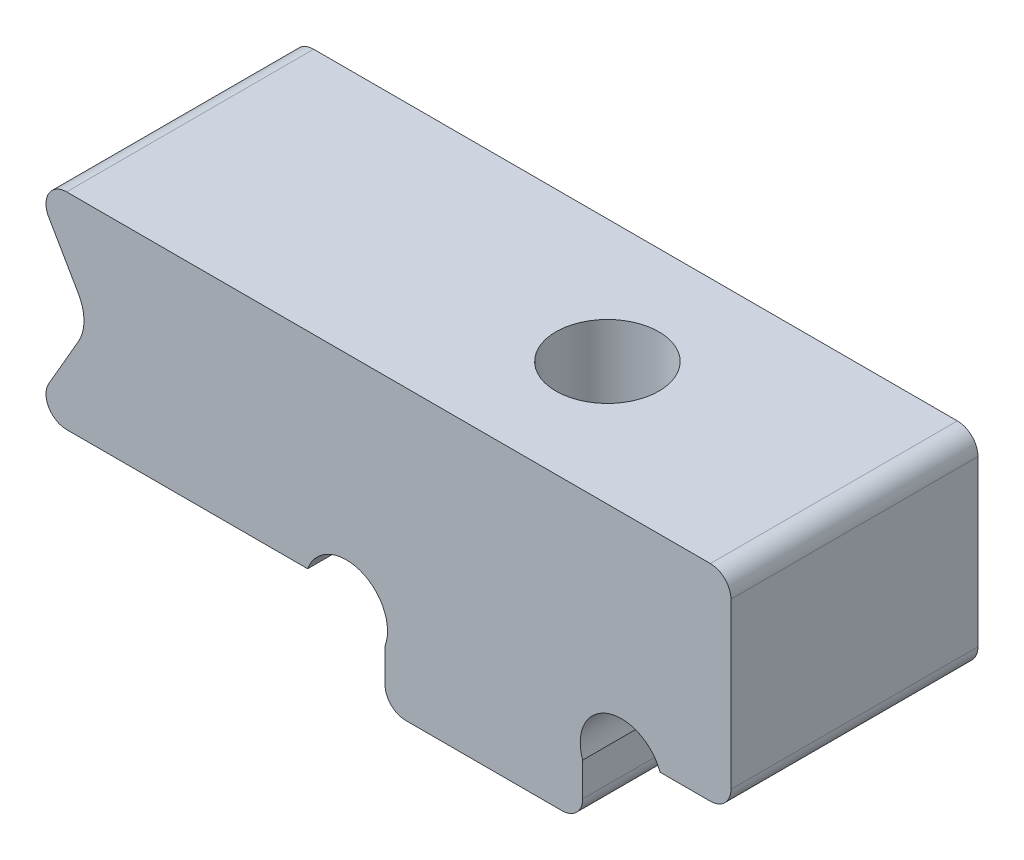
ISO-10303-21;
HEADER;
FILE_DESCRIPTION(('STEP AP214'),'2;1');
FILE_NAME('part.step','',(''),(''),'','','');
FILE_SCHEMA(('AUTOMOTIVE_DESIGN { 1 0 10303 214 1 1 1 1 }'));
ENDSEC;
DATA;
#1=APPLICATION_CONTEXT('core data for automotive mechanical design processes');
#2=APPLICATION_PROTOCOL_DEFINITION('international standard','automotive_design',2000,#1);
#3=PRODUCT_CONTEXT('',#1,'mechanical');
#4=PRODUCT('Part','Part','',(#3));
#5=PRODUCT_RELATED_PRODUCT_CATEGORY('part','',(#4));
#6=PRODUCT_DEFINITION_FORMATION('','',#4);
#7=PRODUCT_DEFINITION_CONTEXT('part definition',#1,'design');
#8=PRODUCT_DEFINITION('design','',#6,#7);
#9=PRODUCT_DEFINITION_SHAPE('','',#8);
#10=(LENGTH_UNIT() NAMED_UNIT(*) SI_UNIT(.MILLI.,.METRE.));
#11=(NAMED_UNIT(*) PLANE_ANGLE_UNIT() SI_UNIT($,.RADIAN.));
#12=(NAMED_UNIT(*) SI_UNIT($,.STERADIAN.) SOLID_ANGLE_UNIT());
#13=UNCERTAINTY_MEASURE_WITH_UNIT(LENGTH_MEASURE(1.E-05),#10,'distance_accuracy_value','');
#14=(GEOMETRIC_REPRESENTATION_CONTEXT(3) GLOBAL_UNCERTAINTY_ASSIGNED_CONTEXT((#13)) GLOBAL_UNIT_ASSIGNED_CONTEXT((#10,
#11,#12)) REPRESENTATION_CONTEXT('',''));
#15=CARTESIAN_POINT('',(0.,0.,0.));
#16=DIRECTION('',(0.,0.,1.));
#17=DIRECTION('',(1.,0.,0.));
#18=AXIS2_PLACEMENT_3D('',#15,#16,#17);
#19=CARTESIAN_POINT('',(6.,0.,3.));
#20=DIRECTION('',(-1.,0.,0.));
#21=DIRECTION('',(0.,0.,1.));
#22=AXIS2_PLACEMENT_3D('',#19,#20,#21);
#23=PLANE('',#22);
#24=DIRECTION('',(0.,1.,0.));
#25=VECTOR('',#24,1.);
#26=CARTESIAN_POINT('',(6.,0.,-3.));
#27=LINE('',#26,#25);
#28=CARTESIAN_POINT('',(6.,0.499999999999999,-3.));
#29=VERTEX_POINT('',#28);
#30=CARTESIAN_POINT('',(6.,4.5,-3.));
#31=VERTEX_POINT('',#30);
#32=EDGE_CURVE('E221',#29,#31,#27,.T.);
#33=ORIENTED_EDGE('',*,*,#32,.T.);
#34=DIRECTION('',(0.,0.,-1.));
#35=VECTOR('',#34,1.);
#36=CARTESIAN_POINT('',(6.,4.5,3.));
#37=LINE('',#36,#35);
#38=CARTESIAN_POINT('',(6.,4.5,3.));
#39=VERTEX_POINT('',#38);
#40=EDGE_CURVE('E278',#31,#39,#37,.F.);
#41=ORIENTED_EDGE('',*,*,#40,.T.);
#42=DIRECTION('',(0.,1.,0.));
#43=VECTOR('',#42,1.);
#44=CARTESIAN_POINT('',(6.,0.,3.));
#45=LINE('',#44,#43);
#46=CARTESIAN_POINT('',(6.,0.499999999999999,3.));
#47=VERTEX_POINT('',#46);
#48=EDGE_CURVE('E247',#47,#39,#45,.T.);
#49=ORIENTED_EDGE('',*,*,#48,.F.);
#50=DIRECTION('',(0.,0.,-1.));
#51=VECTOR('',#50,1.);
#52=CARTESIAN_POINT('',(6.,0.499999999999999,3.));
#53=LINE('',#52,#51);
#54=EDGE_CURVE('E274',#47,#29,#53,.T.);
#55=ORIENTED_EDGE('',*,*,#54,.T.);
#56=EDGE_LOOP('',(#33,#41,#49,#55));
#57=FACE_BOUND('',#56,.T.);
#58=ADVANCED_FACE('F49',(#57),#23,.F.);
#59=CARTESIAN_POINT('',(-6.,5.,3.));
#60=DIRECTION('',(0.,-1.,0.));
#61=DIRECTION('',(0.,0.,-1.));
#62=AXIS2_PLACEMENT_3D('',#59,#60,#61);
#63=PLANE('',#62);
#64=CARTESIAN_POINT('',(0.,5.,0.));
#65=DIRECTION('',(0.,1.,0.));
#66=DIRECTION('',(0.,0.,1.));
#67=AXIS2_PLACEMENT_3D('',#64,#65,#66);
#68=CIRCLE('',#67,1.25);
#69=CARTESIAN_POINT('',(0.,5.,1.25));
#70=VERTEX_POINT('',#69);
#71=EDGE_CURVE('E370',#70,#70,#68,.T.);
#72=ORIENTED_EDGE('',*,*,#71,.F.);
#73=EDGE_LOOP('',(#72));
#74=FACE_BOUND('',#73,.T.);
#75=DIRECTION('',(-1.,0.,0.));
#76=VECTOR('',#75,1.);
#77=CARTESIAN_POINT('',(-6.,5.,3.));
#78=LINE('',#77,#76);
#79=CARTESIAN_POINT('',(5.5,5.,3.));
#80=VERTEX_POINT('',#79);
#81=CARTESIAN_POINT('',(-10.1339745962156,5.,3.));
#82=VERTEX_POINT('',#81);
#83=EDGE_CURVE('E210',#80,#82,#78,.T.);
#84=ORIENTED_EDGE('',*,*,#83,.F.);
#85=DIRECTION('',(0.,0.,-1.));
#86=VECTOR('',#85,1.);
#87=CARTESIAN_POINT('',(5.5,5.,3.));
#88=LINE('',#87,#86);
#89=CARTESIAN_POINT('',(5.5,5.,-3.));
#90=VERTEX_POINT('',#89);
#91=EDGE_CURVE('E250',#80,#90,#88,.T.);
#92=ORIENTED_EDGE('',*,*,#91,.T.);
#93=DIRECTION('',(-1.,0.,0.));
#94=VECTOR('',#93,1.);
#95=CARTESIAN_POINT('',(-6.,5.,-3.));
#96=LINE('',#95,#94);
#97=CARTESIAN_POINT('',(-10.1339745962156,5.,-3.));
#98=VERTEX_POINT('',#97);
#99=EDGE_CURVE('E225',#90,#98,#96,.T.);
#100=ORIENTED_EDGE('',*,*,#99,.T.);
#101=DIRECTION('',(0.,0.,-1.));
#102=VECTOR('',#101,1.);
#103=CARTESIAN_POINT('',(-10.1339745962156,5.,3.));
#104=LINE('',#103,#102);
#105=EDGE_CURVE('E220',#98,#82,#104,.F.);
#106=ORIENTED_EDGE('',*,*,#105,.T.);
#107=EDGE_LOOP('',(#84,#92,#100,#106));
#108=FACE_BOUND('',#107,.T.);
#109=ADVANCED_FACE('F423',(#74,#108),#63,.F.);
#110=CARTESIAN_POINT('',(-6.,0.,3.));
#111=DIRECTION('',(0.,1.,0.));
#112=DIRECTION('',(-1.,0.,0.));
#113=AXIS2_PLACEMENT_3D('',#110,#111,#112);
#114=PLANE('',#113);
#115=DIRECTION('',(1.,0.,0.));
#116=VECTOR('',#115,1.);
#117=CARTESIAN_POINT('',(-6.,0.,-3.));
#118=LINE('',#117,#116);
#119=CARTESIAN_POINT('',(-10.1339745962156,0.,-3.));
#120=VERTEX_POINT('',#119);
#121=CARTESIAN_POINT('',(-4.27938524157181,0.,-3.));
#122=VERTEX_POINT('',#121);
#123=EDGE_CURVE('E230',#120,#122,#118,.T.);
#124=ORIENTED_EDGE('',*,*,#123,.T.);
#125=DIRECTION('',(0.,0.,-1.));
#126=VECTOR('',#125,1.);
#127=CARTESIAN_POINT('',(-4.27938524157181,0.,3.));
#128=LINE('',#127,#126);
#129=CARTESIAN_POINT('',(-4.27938524157181,0.,3.));
#130=VERTEX_POINT('',#129);
#131=EDGE_CURVE('E184',#130,#122,#128,.T.);
#132=ORIENTED_EDGE('',*,*,#131,.F.);
#133=DIRECTION('',(1.,0.,0.));
#134=VECTOR('',#133,1.);
#135=CARTESIAN_POINT('',(-6.,0.,3.));
#136=LINE('',#135,#134);
#137=CARTESIAN_POINT('',(-10.1339745962156,0.,3.));
#138=VERTEX_POINT('',#137);
#139=EDGE_CURVE('E191',#138,#130,#136,.T.);
#140=ORIENTED_EDGE('',*,*,#139,.F.);
#141=DIRECTION('',(0.,0.,1.));
#142=VECTOR('',#141,1.);
#143=CARTESIAN_POINT('',(-10.1339745962156,0.,3.));
#144=LINE('',#143,#142);
#145=EDGE_CURVE('E324',#138,#120,#144,.F.);
#146=ORIENTED_EDGE('',*,*,#145,.T.);
#147=EDGE_LOOP('',(#124,#132,#140,#146));
#148=FACE_BOUND('',#147,.T.);
#149=ADVANCED_FACE('F398',(#148),#114,.F.);
#150=CARTESIAN_POINT('',(-2.4,0.,3.));
#151=DIRECTION('',(1.,0.,0.));
#152=DIRECTION('',(0.,1.,0.));
#153=AXIS2_PLACEMENT_3D('',#150,#151,#152);
#154=PLANE('',#153);
#155=DIRECTION('',(0.,-1.,0.));
#156=VECTOR('',#155,1.);
#157=CARTESIAN_POINT('',(-2.4,0.,3.));
#158=LINE('',#157,#156);
#159=CARTESIAN_POINT('',(-2.4,-0.684040286651345,3.));
#160=VERTEX_POINT('',#159);
#161=CARTESIAN_POINT('',(-2.4,-1.5,3.));
#162=VERTEX_POINT('',#161);
#163=EDGE_CURVE('E188',#160,#162,#158,.T.);
#164=ORIENTED_EDGE('',*,*,#163,.F.);
#165=DIRECTION('',(0.,0.,-1.));
#166=VECTOR('',#165,1.);
#167=CARTESIAN_POINT('',(-2.4,-0.684040286651345,3.));
#168=LINE('',#167,#166);
#169=CARTESIAN_POINT('',(-2.4,-0.684040286651345,-3.));
#170=VERTEX_POINT('',#169);
#171=EDGE_CURVE('E174',#160,#170,#168,.T.);
#172=ORIENTED_EDGE('',*,*,#171,.T.);
#173=DIRECTION('',(0.,-1.,0.));
#174=VECTOR('',#173,1.);
#175=CARTESIAN_POINT('',(-2.4,0.,-3.));
#176=LINE('',#175,#174);
#177=CARTESIAN_POINT('',(-2.4,-1.5,-3.));
#178=VERTEX_POINT('',#177);
#179=EDGE_CURVE('E234',#170,#178,#176,.T.);
#180=ORIENTED_EDGE('',*,*,#179,.T.);
#181=DIRECTION('',(0.,0.,-1.));
#182=VECTOR('',#181,1.);
#183=CARTESIAN_POINT('',(-2.4,-1.5,3.));
#184=LINE('',#183,#182);
#185=EDGE_CURVE('E197',#178,#162,#184,.F.);
#186=ORIENTED_EDGE('',*,*,#185,.T.);
#187=EDGE_LOOP('',(#164,#172,#180,#186));
#188=FACE_BOUND('',#187,.T.);
#189=ADVANCED_FACE('F195',(#188),#154,.F.);
#190=CARTESIAN_POINT('',(-2.4,-2.,3.));
#191=DIRECTION('',(0.,1.,0.));
#192=DIRECTION('',(-1.,0.,0.));
#193=AXIS2_PLACEMENT_3D('',#190,#191,#192);
#194=PLANE('',#193);
#195=CARTESIAN_POINT('',(0.,-2.,0.));
#196=DIRECTION('',(0.,1.,0.));
#197=DIRECTION('',(0.,0.,1.));
#198=AXIS2_PLACEMENT_3D('',#195,#196,#197);
#199=CIRCLE('',#198,1.25);
#200=CARTESIAN_POINT('',(0.,-2.,1.25));
#201=VERTEX_POINT('',#200);
#202=EDGE_CURVE('E226',#201,#201,#199,.T.);
#203=ORIENTED_EDGE('',*,*,#202,.T.);
#204=EDGE_LOOP('',(#203));
#205=FACE_BOUND('',#204,.T.);
#206=DIRECTION('',(1.,0.,0.));
#207=VECTOR('',#206,1.);
#208=CARTESIAN_POINT('',(-2.4,-2.,-3.));
#209=LINE('',#208,#207);
#210=CARTESIAN_POINT('',(-1.9,-2.,-3.));
#211=VERTEX_POINT('',#210);
#212=CARTESIAN_POINT('',(1.9,-2.,-3.));
#213=VERTEX_POINT('',#212);
#214=EDGE_CURVE('E237',#211,#213,#209,.T.);
#215=ORIENTED_EDGE('',*,*,#214,.T.);
#216=DIRECTION('',(0.,0.,-1.));
#217=VECTOR('',#216,1.);
#218=CARTESIAN_POINT('',(1.9,-2.,3.));
#219=LINE('',#218,#217);
#220=CARTESIAN_POINT('',(1.9,-2.,3.));
#221=VERTEX_POINT('',#220);
#222=EDGE_CURVE('E311',#213,#221,#219,.F.);
#223=ORIENTED_EDGE('',*,*,#222,.T.);
#224=DIRECTION('',(1.,0.,0.));
#225=VECTOR('',#224,1.);
#226=CARTESIAN_POINT('',(-2.4,-2.,3.));
#227=LINE('',#226,#225);
#228=CARTESIAN_POINT('',(-1.9,-2.,3.));
#229=VERTEX_POINT('',#228);
#230=EDGE_CURVE('E200',#229,#221,#227,.T.);
#231=ORIENTED_EDGE('',*,*,#230,.F.);
#232=DIRECTION('',(0.,0.,-1.));
#233=VECTOR('',#232,1.);
#234=CARTESIAN_POINT('',(-1.9,-2.,3.));
#235=LINE('',#234,#233);
#236=EDGE_CURVE('E307',#229,#211,#235,.T.);
#237=ORIENTED_EDGE('',*,*,#236,.T.);
#238=EDGE_LOOP('',(#215,#223,#231,#237));
#239=FACE_BOUND('',#238,.T.);
#240=ADVANCED_FACE('F448',(#205,#239),#194,.F.);
#241=CARTESIAN_POINT('',(2.4,0.,3.));
#242=DIRECTION('',(-1.,0.,0.));
#243=DIRECTION('',(0.,-1.,0.));
#244=AXIS2_PLACEMENT_3D('',#241,#242,#243);
#245=PLANE('',#244);
#246=DIRECTION('',(0.,1.,0.));
#247=VECTOR('',#246,1.);
#248=CARTESIAN_POINT('',(2.4,0.,-3.));
#249=LINE('',#248,#247);
#250=CARTESIAN_POINT('',(2.4,-1.5,-3.));
#251=VERTEX_POINT('',#250);
#252=CARTESIAN_POINT('',(2.4,-0.684040286651345,-3.));
#253=VERTEX_POINT('',#252);
#254=EDGE_CURVE('E241',#251,#253,#249,.T.);
#255=ORIENTED_EDGE('',*,*,#254,.T.);
#256=DIRECTION('',(0.,0.,-1.));
#257=VECTOR('',#256,1.);
#258=CARTESIAN_POINT('',(2.4,-0.684040286651345,3.));
#259=LINE('',#258,#257);
#260=CARTESIAN_POINT('',(2.4,-0.684040286651345,3.));
#261=VERTEX_POINT('',#260);
#262=EDGE_CURVE('E346',#261,#253,#259,.T.);
#263=ORIENTED_EDGE('',*,*,#262,.F.);
#264=DIRECTION('',(0.,1.,0.));
#265=VECTOR('',#264,1.);
#266=CARTESIAN_POINT('',(2.4,0.,3.));
#267=LINE('',#266,#265);
#268=CARTESIAN_POINT('',(2.4,-1.5,3.));
#269=VERTEX_POINT('',#268);
#270=EDGE_CURVE('E207',#269,#261,#267,.T.);
#271=ORIENTED_EDGE('',*,*,#270,.F.);
#272=DIRECTION('',(0.,0.,-1.));
#273=VECTOR('',#272,1.);
#274=CARTESIAN_POINT('',(2.4,-1.5,3.));
#275=LINE('',#274,#273);
#276=EDGE_CURVE('E304',#269,#251,#275,.T.);
#277=ORIENTED_EDGE('',*,*,#276,.T.);
#278=EDGE_LOOP('',(#255,#263,#271,#277));
#279=FACE_BOUND('',#278,.T.);
#280=ADVANCED_FACE('F451',(#279),#245,.F.);
#281=CARTESIAN_POINT('',(6.,0.,3.));
#282=DIRECTION('',(0.,1.,0.));
#283=DIRECTION('',(-1.,0.,0.));
#284=AXIS2_PLACEMENT_3D('',#281,#282,#283);
#285=PLANE('',#284);
#286=DIRECTION('',(1.,0.,0.));
#287=VECTOR('',#286,1.);
#288=CARTESIAN_POINT('',(6.,0.,3.));
#289=LINE('',#288,#287);
#290=CARTESIAN_POINT('',(4.27938524157181,0.,3.));
#291=VERTEX_POINT('',#290);
#292=CARTESIAN_POINT('',(5.5,0.,3.));
#293=VERTEX_POINT('',#292);
#294=EDGE_CURVE('E217',#291,#293,#289,.T.);
#295=ORIENTED_EDGE('',*,*,#294,.F.);
#296=DIRECTION('',(0.,0.,-1.));
#297=VECTOR('',#296,1.);
#298=CARTESIAN_POINT('',(4.27938524157181,0.,3.));
#299=LINE('',#298,#297);
#300=CARTESIAN_POINT('',(4.27938524157181,0.,-3.));
#301=VERTEX_POINT('',#300);
#302=EDGE_CURVE('E343',#291,#301,#299,.T.);
#303=ORIENTED_EDGE('',*,*,#302,.T.);
#304=DIRECTION('',(1.,0.,0.));
#305=VECTOR('',#304,1.);
#306=CARTESIAN_POINT('',(6.,0.,-3.));
#307=LINE('',#306,#305);
#308=CARTESIAN_POINT('',(5.5,0.,-3.));
#309=VERTEX_POINT('',#308);
#310=EDGE_CURVE('E244',#301,#309,#307,.T.);
#311=ORIENTED_EDGE('',*,*,#310,.T.);
#312=DIRECTION('',(0.,0.,-1.));
#313=VECTOR('',#312,1.);
#314=CARTESIAN_POINT('',(5.5,0.,3.));
#315=LINE('',#314,#313);
#316=EDGE_CURVE('E300',#309,#293,#315,.F.);
#317=ORIENTED_EDGE('',*,*,#316,.T.);
#318=EDGE_LOOP('',(#295,#303,#311,#317));
#319=FACE_BOUND('',#318,.T.);
#320=ADVANCED_FACE('F349',(#319),#285,.F.);
#321=CARTESIAN_POINT('',(0.,0.,3.));
#322=DIRECTION('',(0.,0.,-1.));
#323=DIRECTION('',(-1.,0.,0.));
#324=AXIS2_PLACEMENT_3D('',#321,#322,#323);
#325=PLANE('',#324);
#326=ORIENTED_EDGE('',*,*,#139,.T.);
#327=CARTESIAN_POINT('',(-3.33969262078591,-0.342020143325673,3.));
#328=DIRECTION('',(0.,0.,-1.));
#329=DIRECTION('',(-1.,0.,0.));
#330=AXIS2_PLACEMENT_3D('',#327,#328,#329);
#331=CIRCLE('',#330,1.);
#332=EDGE_CURVE('E178',#130,#160,#331,.T.);
#333=ORIENTED_EDGE('',*,*,#332,.T.);
#334=ORIENTED_EDGE('',*,*,#163,.T.);
#335=CARTESIAN_POINT('',(-1.9,-1.5,3.));
#336=DIRECTION('',(0.,0.,-1.));
#337=DIRECTION('',(-1.,0.,0.));
#338=AXIS2_PLACEMENT_3D('',#335,#336,#337);
#339=CIRCLE('',#338,0.5);
#340=EDGE_CURVE('E288',#162,#229,#339,.F.);
#341=ORIENTED_EDGE('',*,*,#340,.T.);
#342=ORIENTED_EDGE('',*,*,#230,.T.);
#343=CARTESIAN_POINT('',(1.9,-1.5,3.));
#344=DIRECTION('',(0.,0.,-1.));
#345=DIRECTION('',(-1.,0.,0.));
#346=AXIS2_PLACEMENT_3D('',#343,#344,#345);
#347=CIRCLE('',#346,0.5);
#348=EDGE_CURVE('E291',#221,#269,#347,.F.);
#349=ORIENTED_EDGE('',*,*,#348,.T.);
#350=ORIENTED_EDGE('',*,*,#270,.T.);
#351=CARTESIAN_POINT('',(3.33969262078591,-0.342020143325673,3.));
#352=DIRECTION('',(0.,0.,-1.));
#353=DIRECTION('',(1.,0.,0.));
#354=AXIS2_PLACEMENT_3D('',#351,#352,#353);
#355=CIRCLE('',#354,1.);
#356=EDGE_CURVE('E193',#261,#291,#355,.T.);
#357=ORIENTED_EDGE('',*,*,#356,.T.);
#358=ORIENTED_EDGE('',*,*,#294,.T.);
#359=CARTESIAN_POINT('',(5.5,0.499999999999999,3.));
#360=DIRECTION('',(0.,0.,-1.));
#361=DIRECTION('',(-1.,0.,0.));
#362=AXIS2_PLACEMENT_3D('',#359,#360,#361);
#363=CIRCLE('',#362,0.5);
#364=EDGE_CURVE('E294',#293,#47,#363,.F.);
#365=ORIENTED_EDGE('',*,*,#364,.T.);
#366=ORIENTED_EDGE('',*,*,#48,.T.);
#367=CARTESIAN_POINT('',(5.5,4.5,3.));
#368=DIRECTION('',(0.,0.,-1.));
#369=DIRECTION('',(-1.,0.,0.));
#370=AXIS2_PLACEMENT_3D('',#367,#368,#369);
#371=CIRCLE('',#370,0.5);
#372=EDGE_CURVE('E297',#39,#80,#371,.F.);
#373=ORIENTED_EDGE('',*,*,#372,.T.);
#374=ORIENTED_EDGE('',*,*,#83,.T.);
#375=CARTESIAN_POINT('',(-10.1339745962156,4.5,3.));
#376=DIRECTION('',(0.,0.,-1.));
#377=DIRECTION('',(-1.,0.,0.));
#378=AXIS2_PLACEMENT_3D('',#375,#376,#377);
#379=CIRCLE('',#378,0.5);
#380=CARTESIAN_POINT('',(-10.5669872981078,4.25,3.));
#381=VERTEX_POINT('',#380);
#382=EDGE_CURVE('E284',#82,#381,#379,.F.);
#383=ORIENTED_EDGE('',*,*,#382,.T.);
#384=DIRECTION('',(-0.500000000000001,0.866025403784438,0.));
#385=VECTOR('',#384,1.);
#386=CARTESIAN_POINT('',(-11.,5.,3.));
#387=LINE('',#386,#385);
#388=CARTESIAN_POINT('',(-9.84529946162075,3.,3.));
#389=VERTEX_POINT('',#388);
#390=EDGE_CURVE('E378',#389,#381,#387,.T.);
#391=ORIENTED_EDGE('',*,*,#390,.F.);
#392=CARTESIAN_POINT('',(-10.7113248654052,2.5,3.));
#393=DIRECTION('',(0.,0.,-1.));
#394=DIRECTION('',(-1.,0.,0.));
#395=AXIS2_PLACEMENT_3D('',#392,#393,#394);
#396=CIRCLE('',#395,1.);
#397=CARTESIAN_POINT('',(-9.84529946162075,2.,3.));
#398=VERTEX_POINT('',#397);
#399=EDGE_CURVE('E72',#389,#398,#396,.T.);
#400=ORIENTED_EDGE('',*,*,#399,.T.);
#401=DIRECTION('',(0.500000000000001,0.866025403784438,0.));
#402=VECTOR('',#401,1.);
#403=CARTESIAN_POINT('',(-9.55662432702593,2.5,3.));
#404=LINE('',#403,#402);
#405=CARTESIAN_POINT('',(-10.5669872981078,0.75,3.));
#406=VERTEX_POINT('',#405);
#407=EDGE_CURVE('E382',#406,#398,#404,.T.);
#408=ORIENTED_EDGE('',*,*,#407,.F.);
#409=CARTESIAN_POINT('',(-10.1339745962156,0.499999999999999,3.));
#410=DIRECTION('',(0.,0.,-1.));
#411=DIRECTION('',(-1.,0.,0.));
#412=AXIS2_PLACEMENT_3D('',#409,#410,#411);
#413=CIRCLE('',#412,0.5);
#414=EDGE_CURVE('E281',#406,#138,#413,.F.);
#415=ORIENTED_EDGE('',*,*,#414,.T.);
#416=EDGE_LOOP('',(#326,#333,#334,#341,#342,#349,#350,#357,#358,#365,#366,#373,#374,#383,#391,
#400,#408,#415));
#417=FACE_BOUND('',#416,.T.);
#418=ADVANCED_FACE('F187',(#417),#325,.F.);
#419=CARTESIAN_POINT('',(0.,0.,-3.));
#420=DIRECTION('',(0.,0.,-1.));
#421=DIRECTION('',(-1.,0.,0.));
#422=AXIS2_PLACEMENT_3D('',#419,#420,#421);
#423=PLANE('',#422);
#424=CARTESIAN_POINT('',(-3.33969262078591,-0.342020143325673,-3.));
#425=DIRECTION('',(0.,0.,-1.));
#426=DIRECTION('',(-1.,0.,0.));
#427=AXIS2_PLACEMENT_3D('',#424,#425,#426);
#428=CIRCLE('',#427,1.);
#429=EDGE_CURVE('E11',#122,#170,#428,.T.);
#430=ORIENTED_EDGE('',*,*,#429,.F.);
#431=ORIENTED_EDGE('',*,*,#123,.F.);
#432=CARTESIAN_POINT('',(-10.1339745962156,0.499999999999999,-3.));
#433=DIRECTION('',(0.,0.,-1.));
#434=DIRECTION('',(-1.,0.,0.));
#435=AXIS2_PLACEMENT_3D('',#432,#433,#434);
#436=CIRCLE('',#435,0.5);
#437=CARTESIAN_POINT('',(-10.5669872981078,0.75,-3.));
#438=VERTEX_POINT('',#437);
#439=EDGE_CURVE('E254',#120,#438,#436,.T.);
#440=ORIENTED_EDGE('',*,*,#439,.T.);
#441=DIRECTION('',(0.500000000000001,0.866025403784438,0.));
#442=VECTOR('',#441,1.);
#443=CARTESIAN_POINT('',(-9.55662432702593,2.5,-3.));
#444=LINE('',#443,#442);
#445=CARTESIAN_POINT('',(-9.84529946162075,2.,-3.));
#446=VERTEX_POINT('',#445);
#447=EDGE_CURVE('E381',#438,#446,#444,.T.);
#448=ORIENTED_EDGE('',*,*,#447,.T.);
#449=CARTESIAN_POINT('',(-10.7113248654052,2.5,-3.));
#450=DIRECTION('',(0.,0.,-1.));
#451=DIRECTION('',(-1.,0.,0.));
#452=AXIS2_PLACEMENT_3D('',#449,#450,#451);
#453=CIRCLE('',#452,1.);
#454=CARTESIAN_POINT('',(-9.84529946162075,3.,-3.));
#455=VERTEX_POINT('',#454);
#456=EDGE_CURVE('E336',#446,#455,#453,.F.);
#457=ORIENTED_EDGE('',*,*,#456,.T.);
#458=DIRECTION('',(-0.500000000000001,0.866025403784438,0.));
#459=VECTOR('',#458,1.);
#460=CARTESIAN_POINT('',(-11.,5.,-3.));
#461=LINE('',#460,#459);
#462=CARTESIAN_POINT('',(-10.5669872981078,4.25,-3.));
#463=VERTEX_POINT('',#462);
#464=EDGE_CURVE('E374',#455,#463,#461,.T.);
#465=ORIENTED_EDGE('',*,*,#464,.T.);
#466=CARTESIAN_POINT('',(-10.1339745962156,4.5,-3.));
#467=DIRECTION('',(0.,0.,-1.));
#468=DIRECTION('',(-1.,0.,0.));
#469=AXIS2_PLACEMENT_3D('',#466,#467,#468);
#470=CIRCLE('',#469,0.5);
#471=EDGE_CURVE('E257',#463,#98,#470,.T.);
#472=ORIENTED_EDGE('',*,*,#471,.T.);
#473=ORIENTED_EDGE('',*,*,#99,.F.);
#474=CARTESIAN_POINT('',(5.5,4.5,-3.));
#475=DIRECTION('',(0.,0.,-1.));
#476=DIRECTION('',(-1.,0.,0.));
#477=AXIS2_PLACEMENT_3D('',#474,#475,#476);
#478=CIRCLE('',#477,0.5);
#479=EDGE_CURVE('E271',#90,#31,#478,.T.);
#480=ORIENTED_EDGE('',*,*,#479,.T.);
#481=ORIENTED_EDGE('',*,*,#32,.F.);
#482=CARTESIAN_POINT('',(5.5,0.499999999999999,-3.));
#483=DIRECTION('',(0.,0.,-1.));
#484=DIRECTION('',(-1.,0.,0.));
#485=AXIS2_PLACEMENT_3D('',#482,#483,#484);
#486=CIRCLE('',#485,0.5);
#487=EDGE_CURVE('E267',#29,#309,#486,.T.);
#488=ORIENTED_EDGE('',*,*,#487,.T.);
#489=ORIENTED_EDGE('',*,*,#310,.F.);
#490=CARTESIAN_POINT('',(3.33969262078591,-0.342020143325673,-3.));
#491=DIRECTION('',(0.,0.,-1.));
#492=DIRECTION('',(-1.,0.,0.));
#493=AXIS2_PLACEMENT_3D('',#490,#491,#492);
#494=CIRCLE('',#493,1.);
#495=EDGE_CURVE('E58',#253,#301,#494,.T.);
#496=ORIENTED_EDGE('',*,*,#495,.F.);
#497=ORIENTED_EDGE('',*,*,#254,.F.);
#498=CARTESIAN_POINT('',(1.9,-1.5,-3.));
#499=DIRECTION('',(0.,0.,-1.));
#500=DIRECTION('',(-1.,0.,0.));
#501=AXIS2_PLACEMENT_3D('',#498,#499,#500);
#502=CIRCLE('',#501,0.5);
#503=EDGE_CURVE('E264',#251,#213,#502,.T.);
#504=ORIENTED_EDGE('',*,*,#503,.T.);
#505=ORIENTED_EDGE('',*,*,#214,.F.);
#506=CARTESIAN_POINT('',(-1.9,-1.5,-3.));
#507=DIRECTION('',(0.,0.,-1.));
#508=DIRECTION('',(-1.,0.,0.));
#509=AXIS2_PLACEMENT_3D('',#506,#507,#508);
#510=CIRCLE('',#509,0.5);
#511=EDGE_CURVE('E260',#211,#178,#510,.T.);
#512=ORIENTED_EDGE('',*,*,#511,.T.);
#513=ORIENTED_EDGE('',*,*,#179,.F.);
#514=EDGE_LOOP('',(#430,#431,#440,#448,#457,#465,#472,#473,#480,#481,#488,#489,#496,#497,#504,
#505,#512,#513));
#515=FACE_BOUND('',#514,.T.);
#516=ADVANCED_FACE('F352',(#515),#423,.T.);
#517=CARTESIAN_POINT('',(0.,-2.,0.));
#518=DIRECTION('',(0.,1.,0.));
#519=DIRECTION('',(0.,0.,1.));
#520=AXIS2_PLACEMENT_3D('',#517,#518,#519);
#521=CYLINDRICAL_SURFACE('',#520,1.25);
#522=ORIENTED_EDGE('',*,*,#202,.F.);
#523=EDGE_LOOP('',(#522));
#524=FACE_BOUND('',#523,.T.);
#525=ORIENTED_EDGE('',*,*,#71,.T.);
#526=EDGE_LOOP('',(#525));
#527=FACE_BOUND('',#526,.T.);
#528=ADVANCED_FACE('F460',(#524,#527),#521,.F.);
#529=CARTESIAN_POINT('',(-11.,5.,-3.));
#530=DIRECTION('',(0.866025403784438,0.500000000000001,0.));
#531=DIRECTION('',(-0.500000000000001,0.866025403784438,0.));
#532=AXIS2_PLACEMENT_3D('',#529,#530,#531);
#533=PLANE('',#532);
#534=ORIENTED_EDGE('',*,*,#464,.F.);
#535=DIRECTION('',(0.,0.,1.));
#536=VECTOR('',#535,1.);
#537=CARTESIAN_POINT('',(-9.84529946162075,3.,3.));
#538=LINE('',#537,#536);
#539=EDGE_CURVE('E327',#455,#389,#538,.T.);
#540=ORIENTED_EDGE('',*,*,#539,.T.);
#541=ORIENTED_EDGE('',*,*,#390,.T.);
#542=DIRECTION('',(0.,0.,-1.));
#543=VECTOR('',#542,1.);
#544=CARTESIAN_POINT('',(-10.5669872981078,4.25,-3.));
#545=LINE('',#544,#543);
#546=EDGE_CURVE('E316',#381,#463,#545,.T.);
#547=ORIENTED_EDGE('',*,*,#546,.T.);
#548=EDGE_LOOP('',(#534,#540,#541,#547));
#549=FACE_BOUND('',#548,.T.);
#550=ADVANCED_FACE('F413',(#549),#533,.F.);
#551=CARTESIAN_POINT('',(-9.55662432702593,2.5,-3.));
#552=DIRECTION('',(0.866025403784438,-0.500000000000001,0.));
#553=DIRECTION('',(0.500000000000001,0.866025403784438,0.));
#554=AXIS2_PLACEMENT_3D('',#551,#552,#553);
#555=PLANE('',#554);
#556=ORIENTED_EDGE('',*,*,#407,.T.);
#557=DIRECTION('',(0.,0.,1.));
#558=VECTOR('',#557,1.);
#559=CARTESIAN_POINT('',(-9.84529946162075,2.,-3.));
#560=LINE('',#559,#558);
#561=EDGE_CURVE('E331',#398,#446,#560,.F.);
#562=ORIENTED_EDGE('',*,*,#561,.T.);
#563=ORIENTED_EDGE('',*,*,#447,.F.);
#564=DIRECTION('',(0.,0.,1.));
#565=VECTOR('',#564,1.);
#566=CARTESIAN_POINT('',(-10.5669872981078,0.749999999999999,-3.));
#567=LINE('',#566,#565);
#568=EDGE_CURVE('E320',#438,#406,#567,.T.);
#569=ORIENTED_EDGE('',*,*,#568,.T.);
#570=EDGE_LOOP('',(#556,#562,#563,#569));
#571=FACE_BOUND('',#570,.T.);
#572=ADVANCED_FACE('F406',(#571),#555,.F.);
#573=CARTESIAN_POINT('',(5.5,4.5,3.));
#574=DIRECTION('',(0.,0.,-1.));
#575=DIRECTION('',(-1.,0.,0.));
#576=AXIS2_PLACEMENT_3D('',#573,#574,#575);
#577=CYLINDRICAL_SURFACE('',#576,0.5);
#578=ORIENTED_EDGE('',*,*,#372,.F.);
#579=ORIENTED_EDGE('',*,*,#40,.F.);
#580=ORIENTED_EDGE('',*,*,#479,.F.);
#581=ORIENTED_EDGE('',*,*,#91,.F.);
#582=EDGE_LOOP('',(#578,#579,#580,#581));
#583=FACE_BOUND('',#582,.T.);
#584=ADVANCED_FACE('F426',(#583),#577,.T.);
#585=CARTESIAN_POINT('',(5.5,0.499999999999999,3.));
#586=DIRECTION('',(0.,0.,-1.));
#587=DIRECTION('',(-1.,0.,0.));
#588=AXIS2_PLACEMENT_3D('',#585,#586,#587);
#589=CYLINDRICAL_SURFACE('',#588,0.5);
#590=ORIENTED_EDGE('',*,*,#364,.F.);
#591=ORIENTED_EDGE('',*,*,#316,.F.);
#592=ORIENTED_EDGE('',*,*,#487,.F.);
#593=ORIENTED_EDGE('',*,*,#54,.F.);
#594=EDGE_LOOP('',(#590,#591,#592,#593));
#595=FACE_BOUND('',#594,.T.);
#596=ADVANCED_FACE('F358',(#595),#589,.T.);
#597=CARTESIAN_POINT('',(1.9,-1.5,3.));
#598=DIRECTION('',(0.,0.,-1.));
#599=DIRECTION('',(-1.,0.,0.));
#600=AXIS2_PLACEMENT_3D('',#597,#598,#599);
#601=CYLINDRICAL_SURFACE('',#600,0.5);
#602=ORIENTED_EDGE('',*,*,#348,.F.);
#603=ORIENTED_EDGE('',*,*,#222,.F.);
#604=ORIENTED_EDGE('',*,*,#503,.F.);
#605=ORIENTED_EDGE('',*,*,#276,.F.);
#606=EDGE_LOOP('',(#602,#603,#604,#605));
#607=FACE_BOUND('',#606,.T.);
#608=ADVANCED_FACE('F433',(#607),#601,.T.);
#609=CARTESIAN_POINT('',(-1.9,-1.5,3.));
#610=DIRECTION('',(0.,0.,-1.));
#611=DIRECTION('',(-1.,0.,0.));
#612=AXIS2_PLACEMENT_3D('',#609,#610,#611);
#613=CYLINDRICAL_SURFACE('',#612,0.5);
#614=ORIENTED_EDGE('',*,*,#340,.F.);
#615=ORIENTED_EDGE('',*,*,#185,.F.);
#616=ORIENTED_EDGE('',*,*,#511,.F.);
#617=ORIENTED_EDGE('',*,*,#236,.F.);
#618=EDGE_LOOP('',(#614,#615,#616,#617));
#619=FACE_BOUND('',#618,.T.);
#620=ADVANCED_FACE('F489',(#619),#613,.T.);
#621=CARTESIAN_POINT('',(-10.1339745962156,4.5,-3.));
#622=DIRECTION('',(0.,0.,-1.));
#623=DIRECTION('',(-1.,0.,0.));
#624=AXIS2_PLACEMENT_3D('',#621,#622,#623);
#625=CYLINDRICAL_SURFACE('',#624,0.5);
#626=ORIENTED_EDGE('',*,*,#382,.F.);
#627=ORIENTED_EDGE('',*,*,#105,.F.);
#628=ORIENTED_EDGE('',*,*,#471,.F.);
#629=ORIENTED_EDGE('',*,*,#546,.F.);
#630=EDGE_LOOP('',(#626,#627,#628,#629));
#631=FACE_BOUND('',#630,.T.);
#632=ADVANCED_FACE('F420',(#631),#625,.T.);
#633=CARTESIAN_POINT('',(-10.1339745962156,0.499999999999999,-3.));
#634=DIRECTION('',(0.,0.,1.));
#635=DIRECTION('',(1.,0.,0.));
#636=AXIS2_PLACEMENT_3D('',#633,#634,#635);
#637=CYLINDRICAL_SURFACE('',#636,0.5);
#638=ORIENTED_EDGE('',*,*,#439,.F.);
#639=ORIENTED_EDGE('',*,*,#145,.F.);
#640=ORIENTED_EDGE('',*,*,#414,.F.);
#641=ORIENTED_EDGE('',*,*,#568,.F.);
#642=EDGE_LOOP('',(#638,#639,#640,#641));
#643=FACE_BOUND('',#642,.T.);
#644=ADVANCED_FACE('F404',(#643),#637,.T.);
#645=CARTESIAN_POINT('',(-10.7113248654052,2.5,-3.));
#646=DIRECTION('',(0.,0.,-1.));
#647=DIRECTION('',(-1.,0.,0.));
#648=AXIS2_PLACEMENT_3D('',#645,#646,#647);
#649=CYLINDRICAL_SURFACE('',#648,1.);
#650=ORIENTED_EDGE('',*,*,#456,.F.);
#651=ORIENTED_EDGE('',*,*,#561,.F.);
#652=ORIENTED_EDGE('',*,*,#399,.F.);
#653=ORIENTED_EDGE('',*,*,#539,.F.);
#654=EDGE_LOOP('',(#650,#651,#652,#653));
#655=FACE_BOUND('',#654,.T.);
#656=ADVANCED_FACE('F51',(#655),#649,.F.);
#657=CARTESIAN_POINT('',(3.33969262078591,-0.342020143325673,3.));
#658=DIRECTION('',(0.,0.,-1.));
#659=DIRECTION('',(-1.,0.,0.));
#660=AXIS2_PLACEMENT_3D('',#657,#658,#659);
#661=CYLINDRICAL_SURFACE('',#660,1.);
#662=ORIENTED_EDGE('',*,*,#495,.T.);
#663=ORIENTED_EDGE('',*,*,#302,.F.);
#664=ORIENTED_EDGE('',*,*,#356,.F.);
#665=ORIENTED_EDGE('',*,*,#262,.T.);
#666=EDGE_LOOP('',(#662,#663,#664,#665));
#667=FACE_BOUND('',#666,.T.);
#668=ADVANCED_FACE('F342',(#667),#661,.F.);
#669=CARTESIAN_POINT('',(-3.33969262078591,-0.342020143325673,3.));
#670=DIRECTION('',(0.,0.,-1.));
#671=DIRECTION('',(-1.,0.,0.));
#672=AXIS2_PLACEMENT_3D('',#669,#670,#671);
#673=CYLINDRICAL_SURFACE('',#672,1.);
#674=ORIENTED_EDGE('',*,*,#429,.T.);
#675=ORIENTED_EDGE('',*,*,#171,.F.);
#676=ORIENTED_EDGE('',*,*,#332,.F.);
#677=ORIENTED_EDGE('',*,*,#131,.T.);
#678=EDGE_LOOP('',(#674,#675,#676,#677));
#679=FACE_BOUND('',#678,.T.);
#680=ADVANCED_FACE('F176',(#679),#673,.F.);
#681=CLOSED_SHELL('',(#58,#109,#149,#189,#240,#280,#320,#418,#516,#528,#550,#572,#584,#596,#608,
#620,#632,#644,#656,#668,#680));
#682=MANIFOLD_SOLID_BREP('B2',#681);
#683=ADVANCED_BREP_SHAPE_REPRESENTATION('',(#18,#682),#14);
#684=SHAPE_DEFINITION_REPRESENTATION(#9,#683);
ENDSEC;
END-ISO-10303-21;
